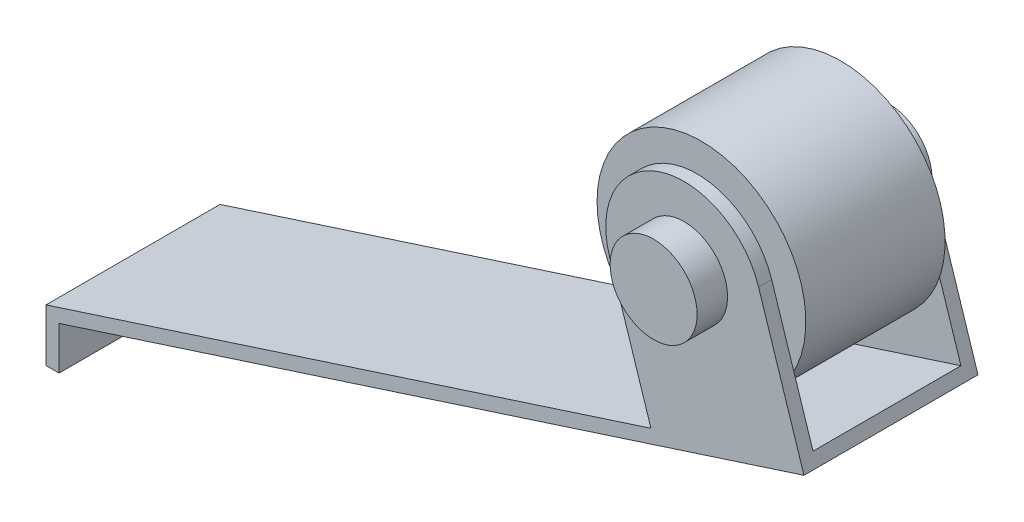
ISO-10303-21;
HEADER;
FILE_DESCRIPTION(('STEP AP214'),'2;1');
FILE_NAME('part.step','',(''),(''),'','','');
FILE_SCHEMA(('AUTOMOTIVE_DESIGN { 1 0 10303 214 1 1 1 1 }'));
ENDSEC;
DATA;
#1=APPLICATION_CONTEXT('core data for automotive mechanical design processes');
#2=APPLICATION_PROTOCOL_DEFINITION('international standard','automotive_design',2000,#1);
#3=PRODUCT_CONTEXT('',#1,'mechanical');
#4=PRODUCT('Part','Part','',(#3));
#5=PRODUCT_RELATED_PRODUCT_CATEGORY('part','',(#4));
#6=PRODUCT_DEFINITION_FORMATION('','',#4);
#7=PRODUCT_DEFINITION_CONTEXT('part definition',#1,'design');
#8=PRODUCT_DEFINITION('design','',#6,#7);
#9=PRODUCT_DEFINITION_SHAPE('','',#8);
#10=(LENGTH_UNIT() NAMED_UNIT(*) SI_UNIT(.MILLI.,.METRE.));
#11=(NAMED_UNIT(*) PLANE_ANGLE_UNIT() SI_UNIT($,.RADIAN.));
#12=(NAMED_UNIT(*) SI_UNIT($,.STERADIAN.) SOLID_ANGLE_UNIT());
#13=UNCERTAINTY_MEASURE_WITH_UNIT(LENGTH_MEASURE(1.E-05),#10,'distance_accuracy_value','');
#14=(GEOMETRIC_REPRESENTATION_CONTEXT(3) GLOBAL_UNCERTAINTY_ASSIGNED_CONTEXT((#13)) GLOBAL_UNIT_ASSIGNED_CONTEXT((#10,
#11,#12)) REPRESENTATION_CONTEXT('',''));
#15=CARTESIAN_POINT('',(0.,0.,0.));
#16=DIRECTION('',(0.,0.,1.));
#17=DIRECTION('',(1.,0.,0.));
#18=AXIS2_PLACEMENT_3D('',#15,#16,#17);
#19=CARTESIAN_POINT('',(14.3663156394455,9.2,-2.));
#20=DIRECTION('',(0.,0.,-1.));
#21=DIRECTION('',(-1.,0.,0.));
#22=AXIS2_PLACEMENT_3D('',#19,#20,#21);
#23=PLANE('',#22);
#24=DIRECTION('',(0.,1.,0.));
#25=VECTOR('',#24,1.);
#26=CARTESIAN_POINT('',(0.,0.,-2.));
#27=LINE('',#26,#25);
#28=CARTESIAN_POINT('',(0.,0.,-2.));
#29=VERTEX_POINT('',#28);
#30=CARTESIAN_POINT('',(0.,0.99,-2.));
#31=VERTEX_POINT('',#30);
#32=EDGE_CURVE('E139',#29,#31,#27,.T.);
#33=ORIENTED_EDGE('',*,*,#32,.F.);
#34=DIRECTION('',(1.,0.,0.));
#35=VECTOR('',#34,1.);
#36=CARTESIAN_POINT('',(0.,0.,-2.));
#37=LINE('',#36,#35);
#38=CARTESIAN_POINT('',(-0.3,0.,-2.));
#39=VERTEX_POINT('',#38);
#40=EDGE_CURVE('E158',#39,#29,#37,.T.);
#41=ORIENTED_EDGE('',*,*,#40,.F.);
#42=DIRECTION('',(0.,-1.,0.));
#43=VECTOR('',#42,1.);
#44=CARTESIAN_POINT('',(-0.3,1.20828821372089,-2.));
#45=LINE('',#44,#43);
#46=CARTESIAN_POINT('',(-0.3,1.20828821372089,-2.));
#47=VERTEX_POINT('',#46);
#48=EDGE_CURVE('E156',#47,#39,#45,.T.);
#49=ORIENTED_EDGE('',*,*,#48,.F.);
#50=DIRECTION('',(-0.951494163295912,-0.307666795760955,0.));
#51=VECTOR('',#50,1.);
#52=CARTESIAN_POINT('',(13.6048484329192,5.70443787803314,-2.));
#53=LINE('',#52,#51);
#54=CARTESIAN_POINT('',(13.6048484329192,5.70443787803314,-2.));
#55=VERTEX_POINT('',#54);
#56=EDGE_CURVE('E154',#55,#47,#53,.T.);
#57=ORIENTED_EDGE('',*,*,#56,.F.);
#58=DIRECTION('',(0.307666795760955,-0.951494163295912,0.));
#59=VECTOR('',#58,1.);
#60=CARTESIAN_POINT('',(13.6048484329192,5.70443787803314,-2.));
#61=LINE('',#60,#59);
#62=CARTESIAN_POINT('',(12.6536261455129,8.64619976763028,-2.));
#63=VERTEX_POINT('',#62);
#64=EDGE_CURVE('E151',#63,#55,#61,.T.);
#65=ORIENTED_EDGE('',*,*,#64,.F.);
#66=CARTESIAN_POINT('',(14.3663156394455,9.2,-2.));
#67=DIRECTION('',(0.,0.,1.));
#68=DIRECTION('',(-1.,0.,0.));
#69=AXIS2_PLACEMENT_3D('',#66,#67,#68);
#70=CIRCLE('',#69,1.8);
#71=CARTESIAN_POINT('',(16.0790051333782,9.75380023236972,-2.));
#72=VERTEX_POINT('',#71);
#73=EDGE_CURVE('E148',#72,#63,#70,.T.);
#74=ORIENTED_EDGE('',*,*,#73,.F.);
#75=DIRECTION('',(-0.307666795760956,0.951494163295912,0.));
#76=VECTOR('',#75,1.);
#77=CARTESIAN_POINT('',(16.0790051333782,9.75380023236972,-2.));
#78=LINE('',#77,#76);
#79=CARTESIAN_POINT('',(17.1225274595127,6.5265900937838,-2.));
#80=VERTEX_POINT('',#79);
#81=EDGE_CURVE('E146',#80,#72,#78,.T.);
#82=ORIENTED_EDGE('',*,*,#81,.F.);
#83=DIRECTION('',(0.951494163295912,0.307666795760955,0.));
#84=VECTOR('',#83,1.);
#85=CARTESIAN_POINT('',(0.,0.99,-2.));
#86=LINE('',#85,#84);
#87=EDGE_CURVE('E144',#31,#80,#86,.T.);
#88=ORIENTED_EDGE('',*,*,#87,.F.);
#89=EDGE_LOOP('',(#33,#41,#49,#57,#65,#74,#82,#88));
#90=FACE_BOUND('',#89,.T.);
#91=CARTESIAN_POINT('',(14.3663156394455,9.2,-2.));
#92=DIRECTION('',(0.,0.,-1.));
#93=DIRECTION('',(-1.,0.,0.));
#94=AXIS2_PLACEMENT_3D('',#91,#92,#93);
#95=CIRCLE('',#94,1.);
#96=CARTESIAN_POINT('',(13.3663156394455,9.2,-2.));
#97=VERTEX_POINT('',#96);
#98=EDGE_CURVE('E217',#97,#97,#95,.F.);
#99=ORIENTED_EDGE('',*,*,#98,.T.);
#100=EDGE_LOOP('',(#99));
#101=FACE_BOUND('',#100,.T.);
#102=ADVANCED_FACE('F17',(#90,#101),#23,.T.);
#103=CARTESIAN_POINT('',(14.3663156394455,9.2,-1.7));
#104=DIRECTION('',(0.,0.,-1.));
#105=DIRECTION('',(-1.,0.,0.));
#106=AXIS2_PLACEMENT_3D('',#103,#104,#105);
#107=PLANE('',#106);
#108=DIRECTION('',(0.307666795760955,-0.951494163295912,0.));
#109=VECTOR('',#108,1.);
#110=CARTESIAN_POINT('',(12.6536261455129,8.64619976763028,-1.7));
#111=LINE('',#110,#109);
#112=CARTESIAN_POINT('',(12.6536261455129,8.64619976763028,-1.7));
#113=VERTEX_POINT('',#112);
#114=CARTESIAN_POINT('',(13.6048484329192,5.70443787803314,-1.7));
#115=VERTEX_POINT('',#114);
#116=EDGE_CURVE('E34',#113,#115,#111,.T.);
#117=ORIENTED_EDGE('',*,*,#116,.T.);
#118=DIRECTION('',(0.951494163295912,0.307666795760955,0.));
#119=VECTOR('',#118,1.);
#120=CARTESIAN_POINT('',(17.0302274207845,6.81203834277258,-1.7));
#121=LINE('',#120,#119);
#122=CARTESIAN_POINT('',(17.0302274207845,6.81203834277258,-1.7));
#123=VERTEX_POINT('',#122);
#124=EDGE_CURVE('E111',#115,#123,#121,.T.);
#125=ORIENTED_EDGE('',*,*,#124,.T.);
#126=DIRECTION('',(-0.307666795760955,0.951494163295912,0.));
#127=VECTOR('',#126,1.);
#128=CARTESIAN_POINT('',(17.0302274207845,6.81203834277258,-1.7));
#129=LINE('',#128,#127);
#130=CARTESIAN_POINT('',(16.0790051333782,9.75380023236972,-1.7));
#131=VERTEX_POINT('',#130);
#132=EDGE_CURVE('E123',#123,#131,#129,.T.);
#133=ORIENTED_EDGE('',*,*,#132,.T.);
#134=CARTESIAN_POINT('',(14.3663156394455,9.2,-1.7));
#135=DIRECTION('',(0.,0.,-1.));
#136=DIRECTION('',(-1.,0.,0.));
#137=AXIS2_PLACEMENT_3D('',#134,#135,#136);
#138=CIRCLE('',#137,1.8);
#139=EDGE_CURVE('E130',#131,#113,#138,.F.);
#140=ORIENTED_EDGE('',*,*,#139,.T.);
#141=EDGE_LOOP('',(#117,#125,#133,#140));
#142=FACE_BOUND('',#141,.T.);
#143=CARTESIAN_POINT('',(14.3663156394455,9.2,-1.7));
#144=DIRECTION('',(0.,0.,-1.));
#145=DIRECTION('',(-1.,0.,0.));
#146=AXIS2_PLACEMENT_3D('',#143,#144,#145);
#147=CIRCLE('',#146,1.);
#148=CARTESIAN_POINT('',(13.3663156394455,9.2,-1.7));
#149=VERTEX_POINT('',#148);
#150=EDGE_CURVE('E11',#149,#149,#147,.F.);
#151=ORIENTED_EDGE('',*,*,#150,.F.);
#152=EDGE_LOOP('',(#151));
#153=FACE_BOUND('',#152,.T.);
#154=ADVANCED_FACE('F121',(#142,#153),#107,.F.);
#155=CARTESIAN_POINT('',(14.3663156394455,9.2,-1.6));
#156=DIRECTION('',(0.,0.,-1.));
#157=DIRECTION('',(-1.,0.,0.));
#158=AXIS2_PLACEMENT_3D('',#155,#156,#157);
#159=PLANE('',#158);
#160=CARTESIAN_POINT('',(14.3663156394455,9.2,-1.6));
#161=DIRECTION('',(0.,0.,-1.));
#162=DIRECTION('',(-1.,0.,0.));
#163=AXIS2_PLACEMENT_3D('',#160,#161,#162);
#164=CIRCLE('',#163,2.4);
#165=CARTESIAN_POINT('',(11.9663156394455,9.2,-1.6));
#166=VERTEX_POINT('',#165);
#167=EDGE_CURVE('E211',#166,#166,#164,.T.);
#168=ORIENTED_EDGE('',*,*,#167,.T.);
#169=EDGE_LOOP('',(#168));
#170=FACE_BOUND('',#169,.T.);
#171=CARTESIAN_POINT('',(14.3663156394455,9.2,-1.6));
#172=DIRECTION('',(0.,0.,-1.));
#173=DIRECTION('',(-1.,0.,0.));
#174=AXIS2_PLACEMENT_3D('',#171,#172,#173);
#175=CIRCLE('',#174,1.);
#176=CARTESIAN_POINT('',(13.3663156394455,9.2,-1.6));
#177=VERTEX_POINT('',#176);
#178=EDGE_CURVE('E223',#177,#177,#175,.T.);
#179=ORIENTED_EDGE('',*,*,#178,.F.);
#180=EDGE_LOOP('',(#179));
#181=FACE_BOUND('',#180,.T.);
#182=ADVANCED_FACE('F230',(#170,#181),#159,.T.);
#183=CARTESIAN_POINT('',(14.3663156394455,9.2,2.));
#184=DIRECTION('',(0.,0.,-1.));
#185=DIRECTION('',(-1.,0.,0.));
#186=AXIS2_PLACEMENT_3D('',#183,#184,#185);
#187=PLANE('',#186);
#188=DIRECTION('',(0.,1.,0.));
#189=VECTOR('',#188,1.);
#190=CARTESIAN_POINT('',(0.,0.,2.));
#191=LINE('',#190,#189);
#192=CARTESIAN_POINT('',(0.,0.,2.));
#193=VERTEX_POINT('',#192);
#194=CARTESIAN_POINT('',(0.,0.99,2.));
#195=VERTEX_POINT('',#194);
#196=EDGE_CURVE('E160',#193,#195,#191,.T.);
#197=ORIENTED_EDGE('',*,*,#196,.T.);
#198=DIRECTION('',(0.951494163295912,0.307666795760955,0.));
#199=VECTOR('',#198,1.);
#200=CARTESIAN_POINT('',(0.,0.99,2.));
#201=LINE('',#200,#199);
#202=CARTESIAN_POINT('',(17.1225274595127,6.5265900937838,2.));
#203=VERTEX_POINT('',#202);
#204=EDGE_CURVE('E162',#195,#203,#201,.T.);
#205=ORIENTED_EDGE('',*,*,#204,.T.);
#206=DIRECTION('',(-0.307666795760956,0.951494163295912,0.));
#207=VECTOR('',#206,1.);
#208=CARTESIAN_POINT('',(16.0790051333782,9.75380023236972,2.));
#209=LINE('',#208,#207);
#210=CARTESIAN_POINT('',(16.0790051333782,9.75380023236972,2.));
#211=VERTEX_POINT('',#210);
#212=EDGE_CURVE('E164',#203,#211,#209,.T.);
#213=ORIENTED_EDGE('',*,*,#212,.T.);
#214=CARTESIAN_POINT('',(14.3663156394455,9.2,2.));
#215=DIRECTION('',(0.,0.,1.));
#216=DIRECTION('',(-1.,0.,0.));
#217=AXIS2_PLACEMENT_3D('',#214,#215,#216);
#218=CIRCLE('',#217,1.8);
#219=CARTESIAN_POINT('',(12.6536261455129,8.64619976763028,2.));
#220=VERTEX_POINT('',#219);
#221=EDGE_CURVE('E166',#211,#220,#218,.T.);
#222=ORIENTED_EDGE('',*,*,#221,.T.);
#223=DIRECTION('',(0.307666795760955,-0.951494163295912,0.));
#224=VECTOR('',#223,1.);
#225=CARTESIAN_POINT('',(13.6048484329192,5.70443787803314,2.));
#226=LINE('',#225,#224);
#227=CARTESIAN_POINT('',(13.6048484329192,5.70443787803314,2.));
#228=VERTEX_POINT('',#227);
#229=EDGE_CURVE('E168',#220,#228,#226,.T.);
#230=ORIENTED_EDGE('',*,*,#229,.T.);
#231=DIRECTION('',(-0.951494163295912,-0.307666795760955,0.));
#232=VECTOR('',#231,1.);
#233=CARTESIAN_POINT('',(13.6048484329192,5.70443787803314,2.));
#234=LINE('',#233,#232);
#235=CARTESIAN_POINT('',(-0.3,1.20828821372089,2.));
#236=VERTEX_POINT('',#235);
#237=EDGE_CURVE('E170',#228,#236,#234,.T.);
#238=ORIENTED_EDGE('',*,*,#237,.T.);
#239=DIRECTION('',(0.,-1.,0.));
#240=VECTOR('',#239,1.);
#241=CARTESIAN_POINT('',(-0.3,1.20828821372089,2.));
#242=LINE('',#241,#240);
#243=CARTESIAN_POINT('',(-0.3,0.,2.));
#244=VERTEX_POINT('',#243);
#245=EDGE_CURVE('E172',#236,#244,#242,.T.);
#246=ORIENTED_EDGE('',*,*,#245,.T.);
#247=DIRECTION('',(1.,0.,0.));
#248=VECTOR('',#247,1.);
#249=CARTESIAN_POINT('',(0.,0.,2.));
#250=LINE('',#249,#248);
#251=EDGE_CURVE('E42',#244,#193,#250,.T.);
#252=ORIENTED_EDGE('',*,*,#251,.T.);
#253=EDGE_LOOP('',(#197,#205,#213,#222,#230,#238,#246,#252));
#254=FACE_BOUND('',#253,.T.);
#255=CARTESIAN_POINT('',(14.3663156394455,9.2,2.));
#256=DIRECTION('',(0.,0.,-1.));
#257=DIRECTION('',(-1.,0.,0.));
#258=AXIS2_PLACEMENT_3D('',#255,#256,#257);
#259=CIRCLE('',#258,1.);
#260=CARTESIAN_POINT('',(13.3663156394455,9.2,2.));
#261=VERTEX_POINT('',#260);
#262=EDGE_CURVE('E26',#261,#261,#259,.F.);
#263=ORIENTED_EDGE('',*,*,#262,.F.);
#264=EDGE_LOOP('',(#263));
#265=FACE_BOUND('',#264,.T.);
#266=ADVANCED_FACE('F232',(#254,#265),#187,.F.);
#267=CARTESIAN_POINT('',(14.3663156394455,9.2,1.7));
#268=DIRECTION('',(0.,0.,-1.));
#269=DIRECTION('',(-1.,0.,0.));
#270=AXIS2_PLACEMENT_3D('',#267,#268,#269);
#271=PLANE('',#270);
#272=DIRECTION('',(-0.951494163295912,-0.307666795760955,0.));
#273=VECTOR('',#272,1.);
#274=CARTESIAN_POINT('',(17.0302274207845,6.81203834277258,1.7));
#275=LINE('',#274,#273);
#276=CARTESIAN_POINT('',(17.0302274207845,6.81203834277258,1.7));
#277=VERTEX_POINT('',#276);
#278=CARTESIAN_POINT('',(13.6048484329192,5.70443787803314,1.7));
#279=VERTEX_POINT('',#278);
#280=EDGE_CURVE('E114',#277,#279,#275,.T.);
#281=ORIENTED_EDGE('',*,*,#280,.T.);
#282=DIRECTION('',(-0.307666795760955,0.951494163295912,0.));
#283=VECTOR('',#282,1.);
#284=CARTESIAN_POINT('',(12.6536261455129,8.64619976763028,1.7));
#285=LINE('',#284,#283);
#286=CARTESIAN_POINT('',(12.6536261455129,8.64619976763028,1.7));
#287=VERTEX_POINT('',#286);
#288=EDGE_CURVE('E138',#279,#287,#285,.T.);
#289=ORIENTED_EDGE('',*,*,#288,.T.);
#290=CARTESIAN_POINT('',(14.3663156394455,9.2,1.7));
#291=DIRECTION('',(0.,0.,-1.));
#292=DIRECTION('',(-1.,0.,0.));
#293=AXIS2_PLACEMENT_3D('',#290,#291,#292);
#294=CIRCLE('',#293,1.8);
#295=CARTESIAN_POINT('',(16.0790051333782,9.75380023236972,1.7));
#296=VERTEX_POINT('',#295);
#297=EDGE_CURVE('E119',#287,#296,#294,.T.);
#298=ORIENTED_EDGE('',*,*,#297,.T.);
#299=DIRECTION('',(0.307666795760955,-0.951494163295912,0.));
#300=VECTOR('',#299,1.);
#301=CARTESIAN_POINT('',(17.0302274207845,6.81203834277258,1.7));
#302=LINE('',#301,#300);
#303=EDGE_CURVE('E135',#296,#277,#302,.T.);
#304=ORIENTED_EDGE('',*,*,#303,.T.);
#305=EDGE_LOOP('',(#281,#289,#298,#304));
#306=FACE_BOUND('',#305,.T.);
#307=CARTESIAN_POINT('',(14.3663156394455,9.2,1.7));
#308=DIRECTION('',(0.,0.,-1.));
#309=DIRECTION('',(-1.,0.,0.));
#310=AXIS2_PLACEMENT_3D('',#307,#308,#309);
#311=CIRCLE('',#310,1.);
#312=CARTESIAN_POINT('',(13.3663156394455,9.2,1.7));
#313=VERTEX_POINT('',#312);
#314=EDGE_CURVE('E21',#313,#313,#311,.F.);
#315=ORIENTED_EDGE('',*,*,#314,.T.);
#316=EDGE_LOOP('',(#315));
#317=FACE_BOUND('',#316,.T.);
#318=ADVANCED_FACE('F240',(#306,#317),#271,.T.);
#319=CARTESIAN_POINT('',(16.0790051333782,9.75380023236972,2.));
#320=DIRECTION('',(-0.951494163295912,-0.307666795760956,0.));
#321=DIRECTION('',(0.307666795760956,-0.951494163295912,0.));
#322=AXIS2_PLACEMENT_3D('',#319,#320,#321);
#323=PLANE('',#322);
#324=ORIENTED_EDGE('',*,*,#303,.F.);
#325=DIRECTION('',(0.,0.,-1.));
#326=VECTOR('',#325,1.);
#327=CARTESIAN_POINT('',(16.0790051333782,9.75380023236972,2.));
#328=LINE('',#327,#326);
#329=EDGE_CURVE('E191',#211,#296,#328,.T.);
#330=ORIENTED_EDGE('',*,*,#329,.F.);
#331=ORIENTED_EDGE('',*,*,#212,.F.);
#332=DIRECTION('',(0.,0.,-1.));
#333=VECTOR('',#332,1.);
#334=CARTESIAN_POINT('',(17.1225274595127,6.5265900937838,2.));
#335=LINE('',#334,#333);
#336=EDGE_CURVE('E194',#203,#80,#335,.T.);
#337=ORIENTED_EDGE('',*,*,#336,.T.);
#338=ORIENTED_EDGE('',*,*,#81,.T.);
#339=EDGE_CURVE('E129',#131,#72,#328,.T.);
#340=ORIENTED_EDGE('',*,*,#339,.F.);
#341=ORIENTED_EDGE('',*,*,#132,.F.);
#342=DIRECTION('',(0.,0.,-1.));
#343=VECTOR('',#342,1.);
#344=CARTESIAN_POINT('',(17.0302274207845,6.81203834277258,8.92600076372985));
#345=LINE('',#344,#343);
#346=EDGE_CURVE('E109',#277,#123,#345,.T.);
#347=ORIENTED_EDGE('',*,*,#346,.F.);
#348=EDGE_LOOP('',(#324,#330,#331,#337,#338,#340,#341,#347));
#349=FACE_BOUND('',#348,.T.);
#350=ADVANCED_FACE('F127',(#349),#323,.F.);
#351=CARTESIAN_POINT('',(14.3663156394455,9.2,2.));
#352=DIRECTION('',(0.,0.,-1.));
#353=DIRECTION('',(-1.,0.,0.));
#354=AXIS2_PLACEMENT_3D('',#351,#352,#353);
#355=CYLINDRICAL_SURFACE('',#354,1.8);
#356=ORIENTED_EDGE('',*,*,#297,.F.);
#357=DIRECTION('',(0.,0.,-1.));
#358=VECTOR('',#357,1.);
#359=CARTESIAN_POINT('',(12.6536261455129,8.64619976763028,2.));
#360=LINE('',#359,#358);
#361=EDGE_CURVE('E188',#220,#287,#360,.T.);
#362=ORIENTED_EDGE('',*,*,#361,.F.);
#363=ORIENTED_EDGE('',*,*,#221,.F.);
#364=ORIENTED_EDGE('',*,*,#329,.T.);
#365=EDGE_LOOP('',(#356,#362,#363,#364));
#366=FACE_BOUND('',#365,.T.);
#367=ADVANCED_FACE('F275',(#366),#355,.T.);
#368=CARTESIAN_POINT('',(13.6048484329192,5.70443787803314,2.));
#369=DIRECTION('',(0.951494163295912,0.307666795760955,0.));
#370=DIRECTION('',(-0.307666795760955,0.951494163295912,0.));
#371=AXIS2_PLACEMENT_3D('',#368,#369,#370);
#372=PLANE('',#371);
#373=ORIENTED_EDGE('',*,*,#288,.F.);
#374=DIRECTION('',(0.,0.,-1.));
#375=VECTOR('',#374,1.);
#376=CARTESIAN_POINT('',(13.6048484329192,5.70443787803314,2.));
#377=LINE('',#376,#375);
#378=EDGE_CURVE('E185',#228,#279,#377,.T.);
#379=ORIENTED_EDGE('',*,*,#378,.F.);
#380=ORIENTED_EDGE('',*,*,#229,.F.);
#381=ORIENTED_EDGE('',*,*,#361,.T.);
#382=EDGE_LOOP('',(#373,#379,#380,#381));
#383=FACE_BOUND('',#382,.T.);
#384=ADVANCED_FACE('F270',(#383),#372,.F.);
#385=CARTESIAN_POINT('',(0.,0.,2.));
#386=DIRECTION('',(-1.,0.,0.));
#387=DIRECTION('',(0.,0.,1.));
#388=AXIS2_PLACEMENT_3D('',#385,#386,#387);
#389=PLANE('',#388);
#390=ORIENTED_EDGE('',*,*,#32,.T.);
#391=DIRECTION('',(0.,0.,-1.));
#392=VECTOR('',#391,1.);
#393=CARTESIAN_POINT('',(0.,0.99,2.));
#394=LINE('',#393,#392);
#395=EDGE_CURVE('E196',#195,#31,#394,.T.);
#396=ORIENTED_EDGE('',*,*,#395,.F.);
#397=ORIENTED_EDGE('',*,*,#196,.F.);
#398=DIRECTION('',(0.,0.,-1.));
#399=VECTOR('',#398,1.);
#400=CARTESIAN_POINT('',(0.,0.,2.));
#401=LINE('',#400,#399);
#402=EDGE_CURVE('E175',#193,#29,#401,.T.);
#403=ORIENTED_EDGE('',*,*,#402,.T.);
#404=EDGE_LOOP('',(#390,#396,#397,#403));
#405=FACE_BOUND('',#404,.T.);
#406=ADVANCED_FACE('F19',(#405),#389,.F.);
#407=CARTESIAN_POINT('',(0.,0.99,2.));
#408=DIRECTION('',(-0.307666795760955,0.951494163295912,0.));
#409=DIRECTION('',(-0.951494163295912,-0.307666795760955,0.));
#410=AXIS2_PLACEMENT_3D('',#407,#408,#409);
#411=PLANE('',#410);
#412=ORIENTED_EDGE('',*,*,#87,.T.);
#413=ORIENTED_EDGE('',*,*,#336,.F.);
#414=ORIENTED_EDGE('',*,*,#204,.F.);
#415=ORIENTED_EDGE('',*,*,#395,.T.);
#416=EDGE_LOOP('',(#412,#413,#414,#415));
#417=FACE_BOUND('',#416,.T.);
#418=ADVANCED_FACE('F273',(#417),#411,.F.);
#419=EDGE_CURVE('E187',#113,#63,#360,.T.);
#420=ORIENTED_EDGE('',*,*,#419,.F.);
#421=ORIENTED_EDGE('',*,*,#139,.F.);
#422=ORIENTED_EDGE('',*,*,#339,.T.);
#423=ORIENTED_EDGE('',*,*,#73,.T.);
#424=EDGE_LOOP('',(#420,#421,#422,#423));
#425=FACE_BOUND('',#424,.T.);
#426=ADVANCED_FACE('F268',(#425),#355,.T.);
#427=EDGE_CURVE('E184',#115,#55,#377,.T.);
#428=ORIENTED_EDGE('',*,*,#427,.F.);
#429=ORIENTED_EDGE('',*,*,#116,.F.);
#430=ORIENTED_EDGE('',*,*,#419,.T.);
#431=ORIENTED_EDGE('',*,*,#64,.T.);
#432=EDGE_LOOP('',(#428,#429,#430,#431));
#433=FACE_BOUND('',#432,.T.);
#434=ADVANCED_FACE('F265',(#433),#372,.F.);
#435=CARTESIAN_POINT('',(13.6048484329192,5.70443787803314,2.));
#436=DIRECTION('',(0.307666795760955,-0.951494163295912,0.));
#437=DIRECTION('',(0.951494163295912,0.307666795760955,0.));
#438=AXIS2_PLACEMENT_3D('',#435,#436,#437);
#439=PLANE('',#438);
#440=ORIENTED_EDGE('',*,*,#56,.T.);
#441=DIRECTION('',(0.,0.,-1.));
#442=VECTOR('',#441,1.);
#443=CARTESIAN_POINT('',(-0.3,1.20828821372089,2.));
#444=LINE('',#443,#442);
#445=EDGE_CURVE('E181',#236,#47,#444,.T.);
#446=ORIENTED_EDGE('',*,*,#445,.F.);
#447=ORIENTED_EDGE('',*,*,#237,.F.);
#448=ORIENTED_EDGE('',*,*,#378,.T.);
#449=ORIENTED_EDGE('',*,*,#280,.F.);
#450=ORIENTED_EDGE('',*,*,#346,.T.);
#451=ORIENTED_EDGE('',*,*,#124,.F.);
#452=ORIENTED_EDGE('',*,*,#427,.T.);
#453=EDGE_LOOP('',(#440,#446,#447,#448,#449,#450,#451,#452));
#454=FACE_BOUND('',#453,.T.);
#455=ADVANCED_FACE('F110',(#454),#439,.F.);
#456=CARTESIAN_POINT('',(-0.3,1.20828821372089,2.));
#457=DIRECTION('',(1.,0.,0.));
#458=DIRECTION('',(0.,1.,0.));
#459=AXIS2_PLACEMENT_3D('',#456,#457,#458);
#460=PLANE('',#459);
#461=ORIENTED_EDGE('',*,*,#48,.T.);
#462=DIRECTION('',(0.,0.,-1.));
#463=VECTOR('',#462,1.);
#464=CARTESIAN_POINT('',(-0.3,0.,2.));
#465=LINE('',#464,#463);
#466=EDGE_CURVE('E178',#244,#39,#465,.T.);
#467=ORIENTED_EDGE('',*,*,#466,.F.);
#468=ORIENTED_EDGE('',*,*,#245,.F.);
#469=ORIENTED_EDGE('',*,*,#445,.T.);
#470=EDGE_LOOP('',(#461,#467,#468,#469));
#471=FACE_BOUND('',#470,.T.);
#472=ADVANCED_FACE('F258',(#471),#460,.F.);
#473=CARTESIAN_POINT('',(0.,0.,2.));
#474=DIRECTION('',(0.,1.,0.));
#475=DIRECTION('',(0.,0.,1.));
#476=AXIS2_PLACEMENT_3D('',#473,#474,#475);
#477=PLANE('',#476);
#478=ORIENTED_EDGE('',*,*,#40,.T.);
#479=ORIENTED_EDGE('',*,*,#402,.F.);
#480=ORIENTED_EDGE('',*,*,#251,.F.);
#481=ORIENTED_EDGE('',*,*,#466,.T.);
#482=EDGE_LOOP('',(#478,#479,#480,#481));
#483=FACE_BOUND('',#482,.T.);
#484=ADVANCED_FACE('F254',(#483),#477,.F.);
#485=CARTESIAN_POINT('',(14.3663156394455,9.2,2.7));
#486=DIRECTION('',(0.,0.,-1.));
#487=DIRECTION('',(-1.,0.,0.));
#488=AXIS2_PLACEMENT_3D('',#485,#486,#487);
#489=CYLINDRICAL_SURFACE('',#488,1.);
#490=ORIENTED_EDGE('',*,*,#314,.F.);
#491=EDGE_LOOP('',(#490));
#492=FACE_BOUND('',#491,.T.);
#493=CARTESIAN_POINT('',(14.3663156394455,9.2,1.6));
#494=DIRECTION('',(0.,0.,-1.));
#495=DIRECTION('',(-1.,0.,0.));
#496=AXIS2_PLACEMENT_3D('',#493,#494,#495);
#497=CIRCLE('',#496,1.);
#498=CARTESIAN_POINT('',(13.3663156394455,9.2,1.6));
#499=VERTEX_POINT('',#498);
#500=EDGE_CURVE('E208',#499,#499,#497,.T.);
#501=ORIENTED_EDGE('',*,*,#500,.F.);
#502=EDGE_LOOP('',(#501));
#503=FACE_BOUND('',#502,.T.);
#504=ADVANCED_FACE('F257',(#492,#503),#489,.T.);
#505=CARTESIAN_POINT('',(14.3663156394455,9.2,2.7));
#506=DIRECTION('',(0.,0.,1.));
#507=DIRECTION('',(1.,0.,0.));
#508=AXIS2_PLACEMENT_3D('',#505,#506,#507);
#509=CIRCLE('',#508,1.);
#510=CARTESIAN_POINT('',(15.3663156394455,9.2,2.7));
#511=VERTEX_POINT('',#510);
#512=EDGE_CURVE('E205',#511,#511,#509,.T.);
#513=ORIENTED_EDGE('',*,*,#512,.F.);
#514=EDGE_LOOP('',(#513));
#515=FACE_BOUND('',#514,.T.);
#516=ORIENTED_EDGE('',*,*,#262,.T.);
#517=EDGE_LOOP('',(#516));
#518=FACE_BOUND('',#517,.T.);
#519=ADVANCED_FACE('F314',(#515,#518),#489,.T.);
#520=CARTESIAN_POINT('',(14.3663156394455,9.2,2.7));
#521=DIRECTION('',(0.,0.,1.));
#522=DIRECTION('',(1.,0.,0.));
#523=AXIS2_PLACEMENT_3D('',#520,#521,#522);
#524=PLANE('',#523);
#525=ORIENTED_EDGE('',*,*,#512,.T.);
#526=EDGE_LOOP('',(#525));
#527=FACE_BOUND('',#526,.T.);
#528=ADVANCED_FACE('F321',(#527),#524,.T.);
#529=CARTESIAN_POINT('',(14.3663156394455,9.2,1.6));
#530=DIRECTION('',(0.,0.,-1.));
#531=DIRECTION('',(-1.,0.,0.));
#532=AXIS2_PLACEMENT_3D('',#529,#530,#531);
#533=PLANE('',#532);
#534=CARTESIAN_POINT('',(14.3663156394455,9.2,1.6));
#535=DIRECTION('',(0.,0.,-1.));
#536=DIRECTION('',(-1.,0.,0.));
#537=AXIS2_PLACEMENT_3D('',#534,#535,#536);
#538=CIRCLE('',#537,2.4);
#539=CARTESIAN_POINT('',(11.9663156394455,9.2,1.6));
#540=VERTEX_POINT('',#539);
#541=EDGE_CURVE('E214',#540,#540,#538,.T.);
#542=ORIENTED_EDGE('',*,*,#541,.F.);
#543=EDGE_LOOP('',(#542));
#544=FACE_BOUND('',#543,.T.);
#545=ORIENTED_EDGE('',*,*,#500,.T.);
#546=EDGE_LOOP('',(#545));
#547=FACE_BOUND('',#546,.T.);
#548=ADVANCED_FACE('F318',(#544,#547),#533,.F.);
#549=CARTESIAN_POINT('',(14.3663156394455,9.2,-1.6));
#550=DIRECTION('',(0.,0.,1.));
#551=DIRECTION('',(1.,0.,0.));
#552=AXIS2_PLACEMENT_3D('',#549,#550,#551);
#553=CYLINDRICAL_SURFACE('',#552,2.4);
#554=ORIENTED_EDGE('',*,*,#167,.F.);
#555=EDGE_LOOP('',(#554));
#556=FACE_BOUND('',#555,.T.);
#557=ORIENTED_EDGE('',*,*,#541,.T.);
#558=EDGE_LOOP('',(#557));
#559=FACE_BOUND('',#558,.T.);
#560=ADVANCED_FACE('F320',(#556,#559),#553,.T.);
#561=CARTESIAN_POINT('',(14.3663156394455,9.2,-2.7));
#562=DIRECTION('',(0.,0.,1.));
#563=DIRECTION('',(1.,0.,0.));
#564=AXIS2_PLACEMENT_3D('',#561,#562,#563);
#565=CYLINDRICAL_SURFACE('',#564,1.);
#566=ORIENTED_EDGE('',*,*,#178,.T.);
#567=EDGE_LOOP('',(#566));
#568=FACE_BOUND('',#567,.T.);
#569=ORIENTED_EDGE('',*,*,#150,.T.);
#570=EDGE_LOOP('',(#569));
#571=FACE_BOUND('',#570,.T.);
#572=ADVANCED_FACE('F227',(#568,#571),#565,.T.);
#573=ORIENTED_EDGE('',*,*,#98,.F.);
#574=EDGE_LOOP('',(#573));
#575=FACE_BOUND('',#574,.T.);
#576=CARTESIAN_POINT('',(14.3663156394455,9.2,-2.7));
#577=DIRECTION('',(0.,0.,-1.));
#578=DIRECTION('',(-1.,0.,0.));
#579=AXIS2_PLACEMENT_3D('',#576,#577,#578);
#580=CIRCLE('',#579,1.);
#581=CARTESIAN_POINT('',(13.3663156394455,9.2,-2.7));
#582=VERTEX_POINT('',#581);
#583=EDGE_CURVE('E219',#582,#582,#580,.T.);
#584=ORIENTED_EDGE('',*,*,#583,.F.);
#585=EDGE_LOOP('',(#584));
#586=FACE_BOUND('',#585,.T.);
#587=ADVANCED_FACE('F332',(#575,#586),#565,.T.);
#588=CARTESIAN_POINT('',(14.3663156394455,9.2,-2.7));
#589=DIRECTION('',(0.,0.,-1.));
#590=DIRECTION('',(-1.,0.,0.));
#591=AXIS2_PLACEMENT_3D('',#588,#589,#590);
#592=PLANE('',#591);
#593=ORIENTED_EDGE('',*,*,#583,.T.);
#594=EDGE_LOOP('',(#593));
#595=FACE_BOUND('',#594,.T.);
#596=ADVANCED_FACE('F335',(#595),#592,.T.);
#597=CLOSED_SHELL('',(#102,#154,#182,#266,#318,#350,#367,#384,#406,#418,#426,#434,#455,#472,
#484,#504,#519,#528,#548,#560,#572,#587,#596));
#598=MANIFOLD_SOLID_BREP('B1',#597);
#599=ADVANCED_BREP_SHAPE_REPRESENTATION('',(#18,#598),#14);
#600=SHAPE_DEFINITION_REPRESENTATION(#9,#599);
ENDSEC;
END-ISO-10303-21;
